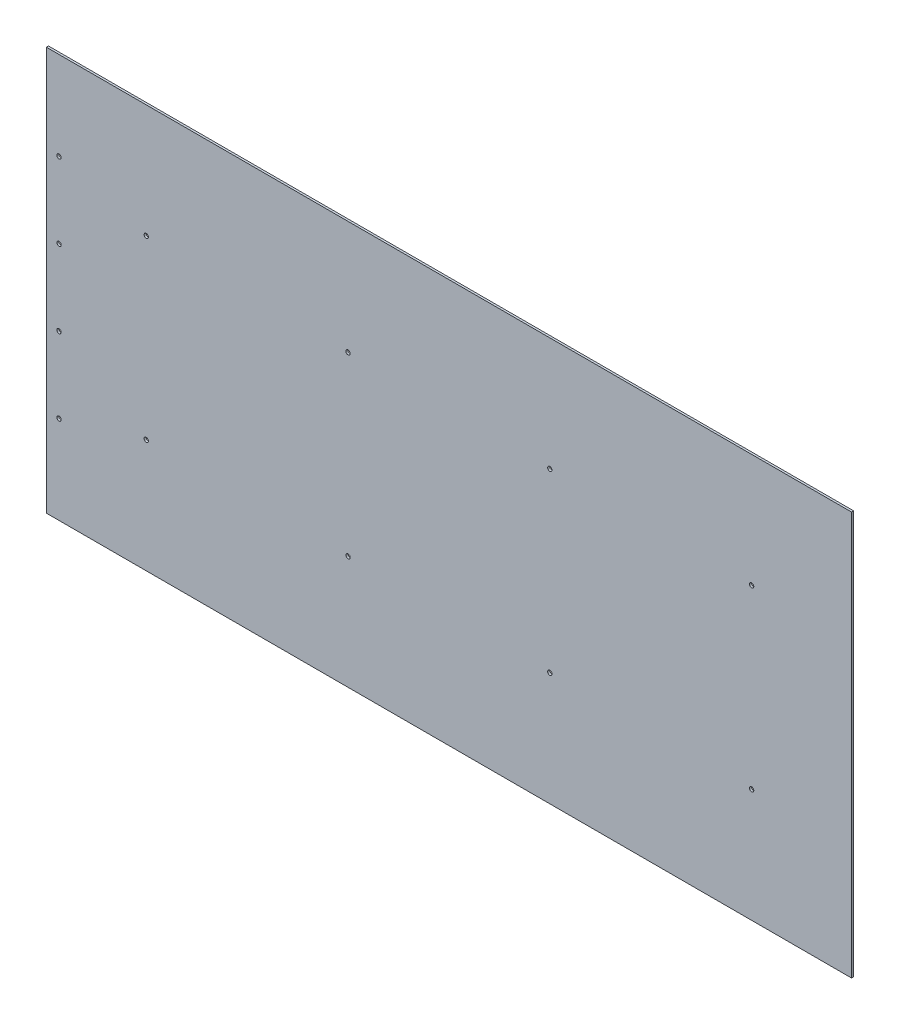
ISO-10303-21;
HEADER;
FILE_DESCRIPTION(('STEP AP214'),'2;1');
FILE_NAME('part.step','',(''),(''),'','','');
FILE_SCHEMA(('AUTOMOTIVE_DESIGN { 1 0 10303 214 1 1 1 1 }'));
ENDSEC;
DATA;
#1=APPLICATION_CONTEXT('core data for automotive mechanical design processes');
#2=APPLICATION_PROTOCOL_DEFINITION('international standard','automotive_design',2000,#1);
#3=PRODUCT_CONTEXT('',#1,'mechanical');
#4=PRODUCT('Part','Part','',(#3));
#5=PRODUCT_RELATED_PRODUCT_CATEGORY('part','',(#4));
#6=PRODUCT_DEFINITION_FORMATION('','',#4);
#7=PRODUCT_DEFINITION_CONTEXT('part definition',#1,'design');
#8=PRODUCT_DEFINITION('design','',#6,#7);
#9=PRODUCT_DEFINITION_SHAPE('','',#8);
#10=(LENGTH_UNIT() NAMED_UNIT(*) SI_UNIT(.MILLI.,.METRE.));
#11=(NAMED_UNIT(*) PLANE_ANGLE_UNIT() SI_UNIT($,.RADIAN.));
#12=(NAMED_UNIT(*) SI_UNIT($,.STERADIAN.) SOLID_ANGLE_UNIT());
#13=UNCERTAINTY_MEASURE_WITH_UNIT(LENGTH_MEASURE(1.E-05),#10,'distance_accuracy_value','');
#14=(GEOMETRIC_REPRESENTATION_CONTEXT(3) GLOBAL_UNCERTAINTY_ASSIGNED_CONTEXT((#13)) GLOBAL_UNIT_ASSIGNED_CONTEXT((#10,
#11,#12)) REPRESENTATION_CONTEXT('',''));
#15=CARTESIAN_POINT('',(0.,0.,0.));
#16=DIRECTION('',(0.,0.,1.));
#17=DIRECTION('',(1.,0.,0.));
#18=AXIS2_PLACEMENT_3D('',#15,#16,#17);
#19=CARTESIAN_POINT('',(0.,0.,3.175));
#20=DIRECTION('',(0.,0.,1.));
#21=DIRECTION('',(1.,0.,0.));
#22=AXIS2_PLACEMENT_3D('',#19,#20,#21);
#23=PLANE('',#22);
#24=CARTESIAN_POINT('',(457.2,133.35,3.175));
#25=DIRECTION('',(0.,0.,-1.));
#26=DIRECTION('',(-1.,0.,0.));
#27=AXIS2_PLACEMENT_3D('',#24,#25,#26);
#28=CIRCLE('',#27,3.302);
#29=CARTESIAN_POINT('',(453.898,133.35,3.175));
#30=VERTEX_POINT('',#29);
#31=EDGE_CURVE('E116',#30,#30,#28,.T.);
#32=ORIENTED_EDGE('',*,*,#31,.T.);
#33=EDGE_LOOP('',(#32));
#34=FACE_BOUND('',#33,.T.);
#35=CARTESIAN_POINT('',(152.4,133.35,3.175));
#36=DIRECTION('',(0.,0.,-1.));
#37=DIRECTION('',(-1.,0.,0.));
#38=AXIS2_PLACEMENT_3D('',#35,#36,#37);
#39=CIRCLE('',#38,3.302);
#40=CARTESIAN_POINT('',(149.098,133.35,3.175));
#41=VERTEX_POINT('',#40);
#42=EDGE_CURVE('E119',#41,#41,#39,.T.);
#43=ORIENTED_EDGE('',*,*,#42,.T.);
#44=EDGE_LOOP('',(#43));
#45=FACE_BOUND('',#44,.T.);
#46=CARTESIAN_POINT('',(-457.2,133.35,3.175));
#47=DIRECTION('',(0.,0.,1.));
#48=DIRECTION('',(1.,0.,0.));
#49=AXIS2_PLACEMENT_3D('',#46,#47,#48);
#50=CIRCLE('',#49,3.302);
#51=CARTESIAN_POINT('',(-453.898,133.35,3.175));
#52=VERTEX_POINT('',#51);
#53=EDGE_CURVE('E122',#52,#52,#50,.F.);
#54=ORIENTED_EDGE('',*,*,#53,.T.);
#55=EDGE_LOOP('',(#54));
#56=FACE_BOUND('',#55,.T.);
#57=CARTESIAN_POINT('',(-152.4,133.35,3.175));
#58=DIRECTION('',(0.,0.,1.));
#59=DIRECTION('',(1.,0.,0.));
#60=AXIS2_PLACEMENT_3D('',#57,#58,#59);
#61=CIRCLE('',#60,3.302);
#62=CARTESIAN_POINT('',(-149.098,133.35,3.175));
#63=VERTEX_POINT('',#62);
#64=EDGE_CURVE('E125',#63,#63,#61,.F.);
#65=ORIENTED_EDGE('',*,*,#64,.T.);
#66=EDGE_LOOP('',(#65));
#67=FACE_BOUND('',#66,.T.);
#68=CARTESIAN_POINT('',(-588.9625,-57.15,3.175));
#69=DIRECTION('',(0.,0.,1.));
#70=DIRECTION('',(1.,0.,0.));
#71=AXIS2_PLACEMENT_3D('',#68,#69,#70);
#72=CIRCLE('',#71,3.302);
#73=CARTESIAN_POINT('',(-585.6605,-57.15,3.175));
#74=VERTEX_POINT('',#73);
#75=EDGE_CURVE('E128',#74,#74,#72,.F.);
#76=ORIENTED_EDGE('',*,*,#75,.T.);
#77=EDGE_LOOP('',(#76));
#78=FACE_BOUND('',#77,.T.);
#79=CARTESIAN_POINT('',(-588.9625,-171.45,3.175));
#80=DIRECTION('',(0.,0.,1.));
#81=DIRECTION('',(1.,0.,0.));
#82=AXIS2_PLACEMENT_3D('',#79,#80,#81);
#83=CIRCLE('',#82,3.302);
#84=CARTESIAN_POINT('',(-585.6605,-171.45,3.175));
#85=VERTEX_POINT('',#84);
#86=EDGE_CURVE('E131',#85,#85,#83,.F.);
#87=ORIENTED_EDGE('',*,*,#86,.T.);
#88=EDGE_LOOP('',(#87));
#89=FACE_BOUND('',#88,.T.);
#90=CARTESIAN_POINT('',(-588.9625,57.15,3.175));
#91=DIRECTION('',(0.,0.,-1.));
#92=DIRECTION('',(-1.,0.,0.));
#93=AXIS2_PLACEMENT_3D('',#90,#91,#92);
#94=CIRCLE('',#93,3.302);
#95=CARTESIAN_POINT('',(-592.2645,57.15,3.175));
#96=VERTEX_POINT('',#95);
#97=EDGE_CURVE('E134',#96,#96,#94,.T.);
#98=ORIENTED_EDGE('',*,*,#97,.T.);
#99=EDGE_LOOP('',(#98));
#100=FACE_BOUND('',#99,.T.);
#101=CARTESIAN_POINT('',(-588.9625,171.45,3.175));
#102=DIRECTION('',(0.,0.,-1.));
#103=DIRECTION('',(-1.,0.,0.));
#104=AXIS2_PLACEMENT_3D('',#101,#102,#103);
#105=CIRCLE('',#104,3.302);
#106=CARTESIAN_POINT('',(-592.2645,171.45,3.175));
#107=VERTEX_POINT('',#106);
#108=EDGE_CURVE('E137',#107,#107,#105,.T.);
#109=ORIENTED_EDGE('',*,*,#108,.T.);
#110=EDGE_LOOP('',(#109));
#111=FACE_BOUND('',#110,.T.);
#112=CARTESIAN_POINT('',(457.2,-133.35,3.175));
#113=DIRECTION('',(0.,0.,1.));
#114=DIRECTION('',(1.,0.,0.));
#115=AXIS2_PLACEMENT_3D('',#112,#113,#114);
#116=CIRCLE('',#115,3.302);
#117=CARTESIAN_POINT('',(460.502,-133.35,3.175));
#118=VERTEX_POINT('',#117);
#119=EDGE_CURVE('E140',#118,#118,#116,.F.);
#120=ORIENTED_EDGE('',*,*,#119,.T.);
#121=EDGE_LOOP('',(#120));
#122=FACE_BOUND('',#121,.T.);
#123=CARTESIAN_POINT('',(152.4,-133.35,3.175));
#124=DIRECTION('',(0.,0.,1.));
#125=DIRECTION('',(1.,0.,0.));
#126=AXIS2_PLACEMENT_3D('',#123,#124,#125);
#127=CIRCLE('',#126,3.302);
#128=CARTESIAN_POINT('',(155.702,-133.35,3.175));
#129=VERTEX_POINT('',#128);
#130=EDGE_CURVE('E143',#129,#129,#127,.F.);
#131=ORIENTED_EDGE('',*,*,#130,.T.);
#132=EDGE_LOOP('',(#131));
#133=FACE_BOUND('',#132,.T.);
#134=CARTESIAN_POINT('',(-457.2,-133.35,3.175));
#135=DIRECTION('',(0.,0.,-1.));
#136=DIRECTION('',(-1.,0.,0.));
#137=AXIS2_PLACEMENT_3D('',#134,#135,#136);
#138=CIRCLE('',#137,3.302);
#139=CARTESIAN_POINT('',(-460.502,-133.35,3.175));
#140=VERTEX_POINT('',#139);
#141=EDGE_CURVE('E145',#140,#140,#138,.T.);
#142=ORIENTED_EDGE('',*,*,#141,.T.);
#143=EDGE_LOOP('',(#142));
#144=FACE_BOUND('',#143,.T.);
#145=CARTESIAN_POINT('',(-152.4,-133.35,3.175));
#146=DIRECTION('',(0.,0.,-1.));
#147=DIRECTION('',(-1.,0.,0.));
#148=AXIS2_PLACEMENT_3D('',#145,#146,#147);
#149=CIRCLE('',#148,3.302);
#150=CARTESIAN_POINT('',(-155.702,-133.35,3.175));
#151=VERTEX_POINT('',#150);
#152=EDGE_CURVE('E20',#151,#151,#149,.T.);
#153=ORIENTED_EDGE('',*,*,#152,.T.);
#154=EDGE_LOOP('',(#153));
#155=FACE_BOUND('',#154,.T.);
#156=DIRECTION('',(1.,0.,0.));
#157=VECTOR('',#156,1.);
#158=CARTESIAN_POINT('',(608.0125,304.8,3.175));
#159=LINE('',#158,#157);
#160=CARTESIAN_POINT('',(-608.0125,304.8,3.175));
#161=VERTEX_POINT('',#160);
#162=CARTESIAN_POINT('',(608.0125,304.8,3.175));
#163=VERTEX_POINT('',#162);
#164=EDGE_CURVE('E71',#161,#163,#159,.T.);
#165=ORIENTED_EDGE('',*,*,#164,.F.);
#166=DIRECTION('',(0.,1.,0.));
#167=VECTOR('',#166,1.);
#168=CARTESIAN_POINT('',(-608.0125,304.8,3.175));
#169=LINE('',#168,#167);
#170=CARTESIAN_POINT('',(-608.0125,-304.8,3.175));
#171=VERTEX_POINT('',#170);
#172=EDGE_CURVE('E68',#171,#161,#169,.T.);
#173=ORIENTED_EDGE('',*,*,#172,.F.);
#174=DIRECTION('',(1.,0.,0.));
#175=VECTOR('',#174,1.);
#176=CARTESIAN_POINT('',(-608.0125,-304.8,3.175));
#177=LINE('',#176,#175);
#178=CARTESIAN_POINT('',(608.0125,-304.8,3.175));
#179=VERTEX_POINT('',#178);
#180=EDGE_CURVE('E59',#179,#171,#177,.F.);
#181=ORIENTED_EDGE('',*,*,#180,.F.);
#182=DIRECTION('',(0.,1.,0.));
#183=VECTOR('',#182,1.);
#184=CARTESIAN_POINT('',(608.0125,-304.8,3.175));
#185=LINE('',#184,#183);
#186=EDGE_CURVE('E54',#163,#179,#185,.F.);
#187=ORIENTED_EDGE('',*,*,#186,.F.);
#188=EDGE_LOOP('',(#165,#173,#181,#187));
#189=FACE_BOUND('',#188,.T.);
#190=ADVANCED_FACE('F17',(#34,#45,#56,#67,#78,#89,#100,#111,#122,#133,#144,#155,#189),#23,.T.);
#191=CARTESIAN_POINT('',(-608.0125,304.8,0.));
#192=DIRECTION('',(-1.,0.,0.));
#193=DIRECTION('',(0.,0.,1.));
#194=AXIS2_PLACEMENT_3D('',#191,#192,#193);
#195=PLANE('',#194);
#196=DIRECTION('',(0.,0.,1.));
#197=VECTOR('',#196,1.);
#198=CARTESIAN_POINT('',(-608.0125,304.8,0.));
#199=LINE('',#198,#197);
#200=CARTESIAN_POINT('',(-608.0125,304.8,0.));
#201=VERTEX_POINT('',#200);
#202=EDGE_CURVE('E153',#201,#161,#199,.T.);
#203=ORIENTED_EDGE('',*,*,#202,.F.);
#204=DIRECTION('',(0.,1.,0.));
#205=VECTOR('',#204,1.);
#206=CARTESIAN_POINT('',(-608.0125,0.,0.));
#207=LINE('',#206,#205);
#208=CARTESIAN_POINT('',(-608.0125,-304.8,0.));
#209=VERTEX_POINT('',#208);
#210=EDGE_CURVE('E78',#201,#209,#207,.F.);
#211=ORIENTED_EDGE('',*,*,#210,.T.);
#212=DIRECTION('',(0.,0.,-1.));
#213=VECTOR('',#212,1.);
#214=CARTESIAN_POINT('',(-608.0125,-304.8,0.));
#215=LINE('',#214,#213);
#216=EDGE_CURVE('E64',#171,#209,#215,.T.);
#217=ORIENTED_EDGE('',*,*,#216,.F.);
#218=ORIENTED_EDGE('',*,*,#172,.T.);
#219=EDGE_LOOP('',(#203,#211,#217,#218));
#220=FACE_BOUND('',#219,.T.);
#221=ADVANCED_FACE('F77',(#220),#195,.T.);
#222=CARTESIAN_POINT('',(-608.0125,-304.8,0.));
#223=DIRECTION('',(0.,-1.,0.));
#224=DIRECTION('',(0.,0.,-1.));
#225=AXIS2_PLACEMENT_3D('',#222,#223,#224);
#226=PLANE('',#225);
#227=ORIENTED_EDGE('',*,*,#216,.T.);
#228=DIRECTION('',(1.,0.,0.));
#229=VECTOR('',#228,1.);
#230=CARTESIAN_POINT('',(0.,-304.8,0.));
#231=LINE('',#230,#229);
#232=CARTESIAN_POINT('',(608.0125,-304.8,0.));
#233=VERTEX_POINT('',#232);
#234=EDGE_CURVE('E164',#209,#233,#231,.T.);
#235=ORIENTED_EDGE('',*,*,#234,.T.);
#236=DIRECTION('',(0.,0.,-1.));
#237=VECTOR('',#236,1.);
#238=CARTESIAN_POINT('',(608.0125,-304.8,0.));
#239=LINE('',#238,#237);
#240=EDGE_CURVE('E66',#179,#233,#239,.T.);
#241=ORIENTED_EDGE('',*,*,#240,.F.);
#242=ORIENTED_EDGE('',*,*,#180,.T.);
#243=EDGE_LOOP('',(#227,#235,#241,#242));
#244=FACE_BOUND('',#243,.T.);
#245=ADVANCED_FACE('F61',(#244),#226,.T.);
#246=CARTESIAN_POINT('',(608.0125,-304.8,0.));
#247=DIRECTION('',(1.,0.,0.));
#248=DIRECTION('',(0.,0.,-1.));
#249=AXIS2_PLACEMENT_3D('',#246,#247,#248);
#250=PLANE('',#249);
#251=ORIENTED_EDGE('',*,*,#240,.T.);
#252=DIRECTION('',(0.,1.,0.));
#253=VECTOR('',#252,1.);
#254=CARTESIAN_POINT('',(608.0125,0.,0.));
#255=LINE('',#254,#253);
#256=CARTESIAN_POINT('',(608.0125,304.8,0.));
#257=VERTEX_POINT('',#256);
#258=EDGE_CURVE('E161',#233,#257,#255,.T.);
#259=ORIENTED_EDGE('',*,*,#258,.T.);
#260=DIRECTION('',(0.,0.,1.));
#261=VECTOR('',#260,1.);
#262=CARTESIAN_POINT('',(608.0125,304.8,0.));
#263=LINE('',#262,#261);
#264=EDGE_CURVE('E35',#163,#257,#263,.F.);
#265=ORIENTED_EDGE('',*,*,#264,.F.);
#266=ORIENTED_EDGE('',*,*,#186,.T.);
#267=EDGE_LOOP('',(#251,#259,#265,#266));
#268=FACE_BOUND('',#267,.T.);
#269=ADVANCED_FACE('F160',(#268),#250,.T.);
#270=CARTESIAN_POINT('',(608.0125,304.8,0.));
#271=DIRECTION('',(0.,1.,0.));
#272=DIRECTION('',(0.,0.,1.));
#273=AXIS2_PLACEMENT_3D('',#270,#271,#272);
#274=PLANE('',#273);
#275=ORIENTED_EDGE('',*,*,#264,.T.);
#276=DIRECTION('',(1.,0.,0.));
#277=VECTOR('',#276,1.);
#278=CARTESIAN_POINT('',(0.,304.8,0.));
#279=LINE('',#278,#277);
#280=EDGE_CURVE('E115',#257,#201,#279,.F.);
#281=ORIENTED_EDGE('',*,*,#280,.T.);
#282=ORIENTED_EDGE('',*,*,#202,.T.);
#283=ORIENTED_EDGE('',*,*,#164,.T.);
#284=EDGE_LOOP('',(#275,#281,#282,#283));
#285=FACE_BOUND('',#284,.T.);
#286=ADVANCED_FACE('F167',(#285),#274,.T.);
#287=CARTESIAN_POINT('',(-152.4,-133.35,3.175));
#288=DIRECTION('',(0.,0.,-1.));
#289=DIRECTION('',(-1.,0.,0.));
#290=AXIS2_PLACEMENT_3D('',#287,#288,#289);
#291=CYLINDRICAL_SURFACE('',#290,3.302);
#292=ORIENTED_EDGE('',*,*,#152,.F.);
#293=EDGE_LOOP('',(#292));
#294=FACE_BOUND('',#293,.T.);
#295=CARTESIAN_POINT('',(-152.4,-133.35,0.));
#296=DIRECTION('',(0.,0.,-1.));
#297=DIRECTION('',(-1.,0.,0.));
#298=AXIS2_PLACEMENT_3D('',#295,#296,#297);
#299=CIRCLE('',#298,3.302);
#300=CARTESIAN_POINT('',(-155.702,-133.35,0.));
#301=VERTEX_POINT('',#300);
#302=EDGE_CURVE('E112',#301,#301,#299,.T.);
#303=ORIENTED_EDGE('',*,*,#302,.T.);
#304=EDGE_LOOP('',(#303));
#305=FACE_BOUND('',#304,.T.);
#306=ADVANCED_FACE('F169',(#294,#305),#291,.F.);
#307=CARTESIAN_POINT('',(-457.2,-133.35,3.175));
#308=DIRECTION('',(0.,0.,-1.));
#309=DIRECTION('',(-1.,0.,0.));
#310=AXIS2_PLACEMENT_3D('',#307,#308,#309);
#311=CYLINDRICAL_SURFACE('',#310,3.302);
#312=CARTESIAN_POINT('',(-457.2,-133.35,0.));
#313=DIRECTION('',(0.,0.,-1.));
#314=DIRECTION('',(-1.,0.,0.));
#315=AXIS2_PLACEMENT_3D('',#312,#313,#314);
#316=CIRCLE('',#315,3.302);
#317=CARTESIAN_POINT('',(-460.502,-133.35,0.));
#318=VERTEX_POINT('',#317);
#319=EDGE_CURVE('E109',#318,#318,#316,.T.);
#320=ORIENTED_EDGE('',*,*,#319,.T.);
#321=EDGE_LOOP('',(#320));
#322=FACE_BOUND('',#321,.T.);
#323=ORIENTED_EDGE('',*,*,#141,.F.);
#324=EDGE_LOOP('',(#323));
#325=FACE_BOUND('',#324,.T.);
#326=ADVANCED_FACE('F176',(#322,#325),#311,.F.);
#327=CARTESIAN_POINT('',(152.4,-133.35,3.175));
#328=DIRECTION('',(0.,0.,1.));
#329=DIRECTION('',(1.,0.,0.));
#330=AXIS2_PLACEMENT_3D('',#327,#328,#329);
#331=CYLINDRICAL_SURFACE('',#330,3.302);
#332=ORIENTED_EDGE('',*,*,#130,.F.);
#333=EDGE_LOOP('',(#332));
#334=FACE_BOUND('',#333,.T.);
#335=CARTESIAN_POINT('',(152.4,-133.35,0.));
#336=DIRECTION('',(0.,0.,1.));
#337=DIRECTION('',(1.,0.,0.));
#338=AXIS2_PLACEMENT_3D('',#335,#336,#337);
#339=CIRCLE('',#338,3.302);
#340=CARTESIAN_POINT('',(155.702,-133.35,0.));
#341=VERTEX_POINT('',#340);
#342=EDGE_CURVE('E106',#341,#341,#339,.F.);
#343=ORIENTED_EDGE('',*,*,#342,.T.);
#344=EDGE_LOOP('',(#343));
#345=FACE_BOUND('',#344,.T.);
#346=ADVANCED_FACE('F223',(#334,#345),#331,.F.);
#347=CARTESIAN_POINT('',(457.2,-133.35,3.175));
#348=DIRECTION('',(0.,0.,1.));
#349=DIRECTION('',(1.,0.,0.));
#350=AXIS2_PLACEMENT_3D('',#347,#348,#349);
#351=CYLINDRICAL_SURFACE('',#350,3.302);
#352=ORIENTED_EDGE('',*,*,#119,.F.);
#353=EDGE_LOOP('',(#352));
#354=FACE_BOUND('',#353,.T.);
#355=CARTESIAN_POINT('',(457.2,-133.35,0.));
#356=DIRECTION('',(0.,0.,1.));
#357=DIRECTION('',(1.,0.,0.));
#358=AXIS2_PLACEMENT_3D('',#355,#356,#357);
#359=CIRCLE('',#358,3.302);
#360=CARTESIAN_POINT('',(460.502,-133.35,0.));
#361=VERTEX_POINT('',#360);
#362=EDGE_CURVE('E103',#361,#361,#359,.F.);
#363=ORIENTED_EDGE('',*,*,#362,.T.);
#364=EDGE_LOOP('',(#363));
#365=FACE_BOUND('',#364,.T.);
#366=ADVANCED_FACE('F219',(#354,#365),#351,.F.);
#367=CARTESIAN_POINT('',(-588.9625,171.45,3.175));
#368=DIRECTION('',(0.,0.,-1.));
#369=DIRECTION('',(-1.,0.,0.));
#370=AXIS2_PLACEMENT_3D('',#367,#368,#369);
#371=CYLINDRICAL_SURFACE('',#370,3.302);
#372=ORIENTED_EDGE('',*,*,#108,.F.);
#373=EDGE_LOOP('',(#372));
#374=FACE_BOUND('',#373,.T.);
#375=CARTESIAN_POINT('',(-588.9625,171.45,0.));
#376=DIRECTION('',(0.,0.,-1.));
#377=DIRECTION('',(-1.,0.,0.));
#378=AXIS2_PLACEMENT_3D('',#375,#376,#377);
#379=CIRCLE('',#378,3.302);
#380=CARTESIAN_POINT('',(-592.2645,171.45,0.));
#381=VERTEX_POINT('',#380);
#382=EDGE_CURVE('E100',#381,#381,#379,.T.);
#383=ORIENTED_EDGE('',*,*,#382,.T.);
#384=EDGE_LOOP('',(#383));
#385=FACE_BOUND('',#384,.T.);
#386=ADVANCED_FACE('F215',(#374,#385),#371,.F.);
#387=CARTESIAN_POINT('',(-588.9625,57.15,3.175));
#388=DIRECTION('',(0.,0.,-1.));
#389=DIRECTION('',(-1.,0.,0.));
#390=AXIS2_PLACEMENT_3D('',#387,#388,#389);
#391=CYLINDRICAL_SURFACE('',#390,3.302);
#392=ORIENTED_EDGE('',*,*,#97,.F.);
#393=EDGE_LOOP('',(#392));
#394=FACE_BOUND('',#393,.T.);
#395=CARTESIAN_POINT('',(-588.9625,57.15,0.));
#396=DIRECTION('',(0.,0.,-1.));
#397=DIRECTION('',(-1.,0.,0.));
#398=AXIS2_PLACEMENT_3D('',#395,#396,#397);
#399=CIRCLE('',#398,3.302);
#400=CARTESIAN_POINT('',(-592.2645,57.15,0.));
#401=VERTEX_POINT('',#400);
#402=EDGE_CURVE('E97',#401,#401,#399,.T.);
#403=ORIENTED_EDGE('',*,*,#402,.T.);
#404=EDGE_LOOP('',(#403));
#405=FACE_BOUND('',#404,.T.);
#406=ADVANCED_FACE('F211',(#394,#405),#391,.F.);
#407=CARTESIAN_POINT('',(-588.9625,-171.45,3.175));
#408=DIRECTION('',(0.,0.,1.));
#409=DIRECTION('',(1.,0.,0.));
#410=AXIS2_PLACEMENT_3D('',#407,#408,#409);
#411=CYLINDRICAL_SURFACE('',#410,3.302);
#412=ORIENTED_EDGE('',*,*,#86,.F.);
#413=EDGE_LOOP('',(#412));
#414=FACE_BOUND('',#413,.T.);
#415=CARTESIAN_POINT('',(-588.9625,-171.45,0.));
#416=DIRECTION('',(0.,0.,1.));
#417=DIRECTION('',(1.,0.,0.));
#418=AXIS2_PLACEMENT_3D('',#415,#416,#417);
#419=CIRCLE('',#418,3.302);
#420=CARTESIAN_POINT('',(-585.6605,-171.45,0.));
#421=VERTEX_POINT('',#420);
#422=EDGE_CURVE('E94',#421,#421,#419,.F.);
#423=ORIENTED_EDGE('',*,*,#422,.T.);
#424=EDGE_LOOP('',(#423));
#425=FACE_BOUND('',#424,.T.);
#426=ADVANCED_FACE('F207',(#414,#425),#411,.F.);
#427=CARTESIAN_POINT('',(-588.9625,-57.15,3.175));
#428=DIRECTION('',(0.,0.,1.));
#429=DIRECTION('',(1.,0.,0.));
#430=AXIS2_PLACEMENT_3D('',#427,#428,#429);
#431=CYLINDRICAL_SURFACE('',#430,3.302);
#432=ORIENTED_EDGE('',*,*,#75,.F.);
#433=EDGE_LOOP('',(#432));
#434=FACE_BOUND('',#433,.T.);
#435=CARTESIAN_POINT('',(-588.9625,-57.15,0.));
#436=DIRECTION('',(0.,0.,1.));
#437=DIRECTION('',(1.,0.,0.));
#438=AXIS2_PLACEMENT_3D('',#435,#436,#437);
#439=CIRCLE('',#438,3.302);
#440=CARTESIAN_POINT('',(-585.6605,-57.15,0.));
#441=VERTEX_POINT('',#440);
#442=EDGE_CURVE('E91',#441,#441,#439,.F.);
#443=ORIENTED_EDGE('',*,*,#442,.T.);
#444=EDGE_LOOP('',(#443));
#445=FACE_BOUND('',#444,.T.);
#446=ADVANCED_FACE('F203',(#434,#445),#431,.F.);
#447=CARTESIAN_POINT('',(-152.4,133.35,3.175));
#448=DIRECTION('',(0.,0.,1.));
#449=DIRECTION('',(1.,0.,0.));
#450=AXIS2_PLACEMENT_3D('',#447,#448,#449);
#451=CYLINDRICAL_SURFACE('',#450,3.302);
#452=ORIENTED_EDGE('',*,*,#64,.F.);
#453=EDGE_LOOP('',(#452));
#454=FACE_BOUND('',#453,.T.);
#455=CARTESIAN_POINT('',(-152.4,133.35,0.));
#456=DIRECTION('',(0.,0.,1.));
#457=DIRECTION('',(1.,0.,0.));
#458=AXIS2_PLACEMENT_3D('',#455,#456,#457);
#459=CIRCLE('',#458,3.302);
#460=CARTESIAN_POINT('',(-149.098,133.35,0.));
#461=VERTEX_POINT('',#460);
#462=EDGE_CURVE('E88',#461,#461,#459,.F.);
#463=ORIENTED_EDGE('',*,*,#462,.T.);
#464=EDGE_LOOP('',(#463));
#465=FACE_BOUND('',#464,.T.);
#466=ADVANCED_FACE('F199',(#454,#465),#451,.F.);
#467=CARTESIAN_POINT('',(-457.2,133.35,3.175));
#468=DIRECTION('',(0.,0.,1.));
#469=DIRECTION('',(1.,0.,0.));
#470=AXIS2_PLACEMENT_3D('',#467,#468,#469);
#471=CYLINDRICAL_SURFACE('',#470,3.302);
#472=ORIENTED_EDGE('',*,*,#53,.F.);
#473=EDGE_LOOP('',(#472));
#474=FACE_BOUND('',#473,.T.);
#475=CARTESIAN_POINT('',(-457.2,133.35,0.));
#476=DIRECTION('',(0.,0.,1.));
#477=DIRECTION('',(1.,0.,0.));
#478=AXIS2_PLACEMENT_3D('',#475,#476,#477);
#479=CIRCLE('',#478,3.302);
#480=CARTESIAN_POINT('',(-453.898,133.35,0.));
#481=VERTEX_POINT('',#480);
#482=EDGE_CURVE('E85',#481,#481,#479,.F.);
#483=ORIENTED_EDGE('',*,*,#482,.T.);
#484=EDGE_LOOP('',(#483));
#485=FACE_BOUND('',#484,.T.);
#486=ADVANCED_FACE('F195',(#474,#485),#471,.F.);
#487=CARTESIAN_POINT('',(152.4,133.35,3.175));
#488=DIRECTION('',(0.,0.,-1.));
#489=DIRECTION('',(-1.,0.,0.));
#490=AXIS2_PLACEMENT_3D('',#487,#488,#489);
#491=CYLINDRICAL_SURFACE('',#490,3.302);
#492=CARTESIAN_POINT('',(152.4,133.35,0.));
#493=DIRECTION('',(0.,0.,-1.));
#494=DIRECTION('',(-1.,0.,0.));
#495=AXIS2_PLACEMENT_3D('',#492,#493,#494);
#496=CIRCLE('',#495,3.302);
#497=CARTESIAN_POINT('',(149.098,133.35,0.));
#498=VERTEX_POINT('',#497);
#499=EDGE_CURVE('E26',#498,#498,#496,.T.);
#500=ORIENTED_EDGE('',*,*,#499,.T.);
#501=EDGE_LOOP('',(#500));
#502=FACE_BOUND('',#501,.T.);
#503=ORIENTED_EDGE('',*,*,#42,.F.);
#504=EDGE_LOOP('',(#503));
#505=FACE_BOUND('',#504,.T.);
#506=ADVANCED_FACE('F187',(#502,#505),#491,.F.);
#507=CARTESIAN_POINT('',(457.2,133.35,3.175));
#508=DIRECTION('',(0.,0.,-1.));
#509=DIRECTION('',(-1.,0.,0.));
#510=AXIS2_PLACEMENT_3D('',#507,#508,#509);
#511=CYLINDRICAL_SURFACE('',#510,3.302);
#512=CARTESIAN_POINT('',(457.2,133.35,0.));
#513=DIRECTION('',(0.,0.,-1.));
#514=DIRECTION('',(-1.,0.,0.));
#515=AXIS2_PLACEMENT_3D('',#512,#513,#514);
#516=CIRCLE('',#515,3.302);
#517=CARTESIAN_POINT('',(453.898,133.35,0.));
#518=VERTEX_POINT('',#517);
#519=EDGE_CURVE('E11',#518,#518,#516,.T.);
#520=ORIENTED_EDGE('',*,*,#519,.T.);
#521=EDGE_LOOP('',(#520));
#522=FACE_BOUND('',#521,.T.);
#523=ORIENTED_EDGE('',*,*,#31,.F.);
#524=EDGE_LOOP('',(#523));
#525=FACE_BOUND('',#524,.T.);
#526=ADVANCED_FACE('F181',(#522,#525),#511,.F.);
#527=CARTESIAN_POINT('',(0.,0.,0.));
#528=DIRECTION('',(0.,0.,1.));
#529=DIRECTION('',(1.,0.,0.));
#530=AXIS2_PLACEMENT_3D('',#527,#528,#529);
#531=PLANE('',#530);
#532=ORIENTED_EDGE('',*,*,#519,.F.);
#533=EDGE_LOOP('',(#532));
#534=FACE_BOUND('',#533,.T.);
#535=ORIENTED_EDGE('',*,*,#499,.F.);
#536=EDGE_LOOP('',(#535));
#537=FACE_BOUND('',#536,.T.);
#538=ORIENTED_EDGE('',*,*,#482,.F.);
#539=EDGE_LOOP('',(#538));
#540=FACE_BOUND('',#539,.T.);
#541=ORIENTED_EDGE('',*,*,#462,.F.);
#542=EDGE_LOOP('',(#541));
#543=FACE_BOUND('',#542,.T.);
#544=ORIENTED_EDGE('',*,*,#442,.F.);
#545=EDGE_LOOP('',(#544));
#546=FACE_BOUND('',#545,.T.);
#547=ORIENTED_EDGE('',*,*,#422,.F.);
#548=EDGE_LOOP('',(#547));
#549=FACE_BOUND('',#548,.T.);
#550=ORIENTED_EDGE('',*,*,#402,.F.);
#551=EDGE_LOOP('',(#550));
#552=FACE_BOUND('',#551,.T.);
#553=ORIENTED_EDGE('',*,*,#382,.F.);
#554=EDGE_LOOP('',(#553));
#555=FACE_BOUND('',#554,.T.);
#556=ORIENTED_EDGE('',*,*,#362,.F.);
#557=EDGE_LOOP('',(#556));
#558=FACE_BOUND('',#557,.T.);
#559=ORIENTED_EDGE('',*,*,#342,.F.);
#560=EDGE_LOOP('',(#559));
#561=FACE_BOUND('',#560,.T.);
#562=ORIENTED_EDGE('',*,*,#319,.F.);
#563=EDGE_LOOP('',(#562));
#564=FACE_BOUND('',#563,.T.);
#565=ORIENTED_EDGE('',*,*,#302,.F.);
#566=EDGE_LOOP('',(#565));
#567=FACE_BOUND('',#566,.T.);
#568=ORIENTED_EDGE('',*,*,#258,.F.);
#569=ORIENTED_EDGE('',*,*,#234,.F.);
#570=ORIENTED_EDGE('',*,*,#210,.F.);
#571=ORIENTED_EDGE('',*,*,#280,.F.);
#572=EDGE_LOOP('',(#568,#569,#570,#571));
#573=FACE_BOUND('',#572,.T.);
#574=ADVANCED_FACE('F163',(#534,#537,#540,#543,#546,#549,#552,#555,#558,#561,#564,#567,#573),
#531,.F.);
#575=CLOSED_SHELL('',(#190,#221,#245,#269,#286,#306,#326,#346,#366,#386,#406,#426,#446,#466,
#486,#506,#526,#574));
#576=MANIFOLD_SOLID_BREP('B1',#575);
#577=ADVANCED_BREP_SHAPE_REPRESENTATION('',(#18,#576),#14);
#578=SHAPE_DEFINITION_REPRESENTATION(#9,#577);
ENDSEC;
END-ISO-10303-21;
